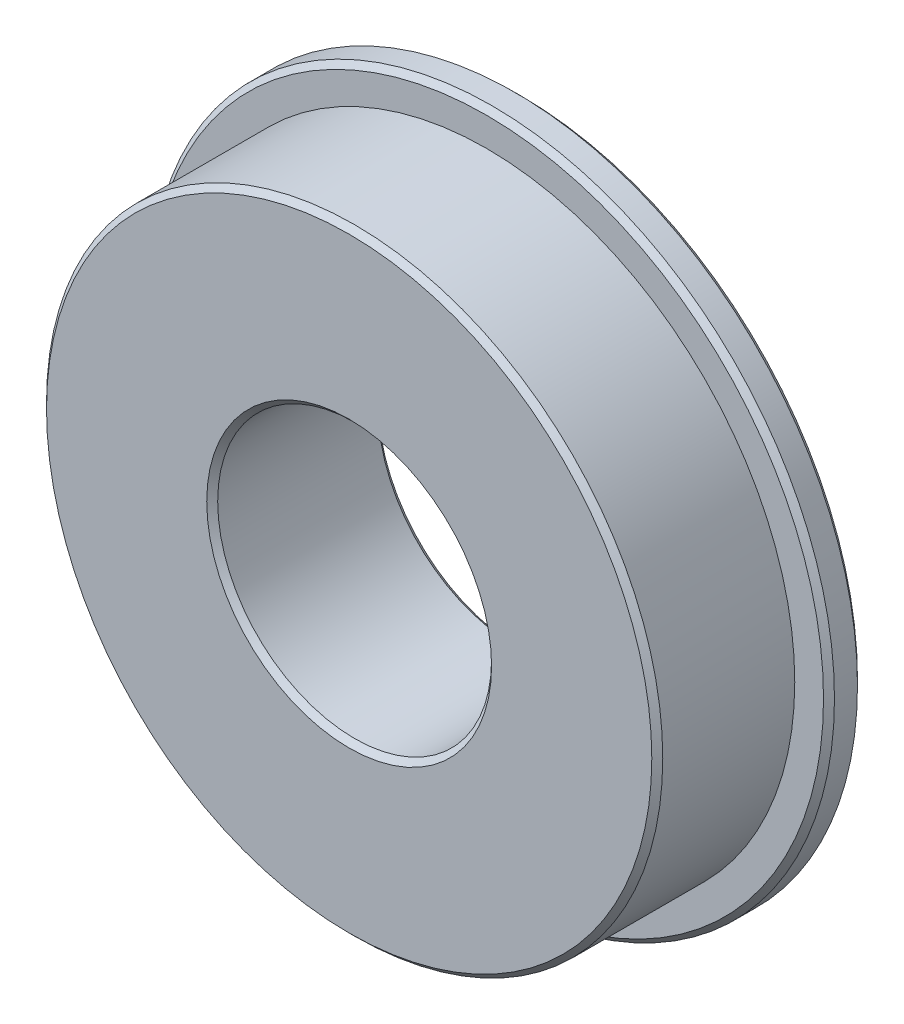
ISO-10303-21;
HEADER;
FILE_DESCRIPTION(('STEP AP214'),'2;1');
FILE_NAME('part.step','',(''),(''),'','','');
FILE_SCHEMA(('AUTOMOTIVE_DESIGN { 1 0 10303 214 1 1 1 1 }'));
ENDSEC;
DATA;
#1=APPLICATION_CONTEXT('core data for automotive mechanical design processes');
#2=APPLICATION_PROTOCOL_DEFINITION('international standard','automotive_design',2000,#1);
#3=PRODUCT_CONTEXT('',#1,'mechanical');
#4=PRODUCT('Part','Part','',(#3));
#5=PRODUCT_RELATED_PRODUCT_CATEGORY('part','',(#4));
#6=PRODUCT_DEFINITION_FORMATION('','',#4);
#7=PRODUCT_DEFINITION_CONTEXT('part definition',#1,'design');
#8=PRODUCT_DEFINITION('design','',#6,#7);
#9=PRODUCT_DEFINITION_SHAPE('','',#8);
#10=(LENGTH_UNIT() NAMED_UNIT(*) SI_UNIT(.MILLI.,.METRE.));
#11=(NAMED_UNIT(*) PLANE_ANGLE_UNIT() SI_UNIT($,.RADIAN.));
#12=(NAMED_UNIT(*) SI_UNIT($,.STERADIAN.) SOLID_ANGLE_UNIT());
#13=UNCERTAINTY_MEASURE_WITH_UNIT(LENGTH_MEASURE(1.E-05),#10,'distance_accuracy_value','');
#14=(GEOMETRIC_REPRESENTATION_CONTEXT(3) GLOBAL_UNCERTAINTY_ASSIGNED_CONTEXT((#13)) GLOBAL_UNIT_ASSIGNED_CONTEXT((#10,
#11,#12)) REPRESENTATION_CONTEXT('',''));
#15=CARTESIAN_POINT('',(0.,0.,0.));
#16=DIRECTION('',(0.,0.,1.));
#17=DIRECTION('',(1.,0.,0.));
#18=AXIS2_PLACEMENT_3D('',#15,#16,#17);
#19=CARTESIAN_POINT('',(-8.86153846180001,6.04195804306,0.));
#20=DIRECTION('',(0.,0.,1.));
#21=DIRECTION('',(1.,0.,0.));
#22=AXIS2_PLACEMENT_3D('',#19,#20,#21);
#23=CONICAL_SURFACE('',#22,15.621,0.785398163397446);
#24=CARTESIAN_POINT('',(-8.86153846180001,6.04195804306,0.));
#25=DIRECTION('',(0.,0.,1.));
#26=DIRECTION('',(1.,0.,0.));
#27=AXIS2_PLACEMENT_3D('',#24,#25,#26);
#28=CIRCLE('',#27,15.621);
#29=CARTESIAN_POINT('',(6.7594615382,6.04195804306,0.));
#30=VERTEX_POINT('',#29);
#31=EDGE_CURVE('E20',#30,#30,#28,.T.);
#32=ORIENTED_EDGE('',*,*,#31,.T.);
#33=EDGE_LOOP('',(#32));
#34=FACE_BOUND('',#33,.T.);
#35=CARTESIAN_POINT('',(-8.86153846180001,6.04195804306,0.2539999991872));
#36=DIRECTION('',(0.,0.,1.));
#37=DIRECTION('',(-1.,0.,0.));
#38=AXIS2_PLACEMENT_3D('',#35,#36,#37);
#39=CIRCLE('',#38,15.875);
#40=CARTESIAN_POINT('',(-24.7365384618,6.04195804306,0.2539999991872));
#41=VERTEX_POINT('',#40);
#42=EDGE_CURVE('E52',#41,#41,#39,.F.);
#43=ORIENTED_EDGE('',*,*,#42,.T.);
#44=EDGE_LOOP('',(#43));
#45=FACE_BOUND('',#44,.T.);
#46=ADVANCED_FACE('F17',(#34,#45),#23,.T.);
#47=CARTESIAN_POINT('',(0.,0.,0.));
#48=DIRECTION('',(0.,0.,-1.));
#49=DIRECTION('',(-1.,0.,0.));
#50=AXIS2_PLACEMENT_3D('',#47,#48,#49);
#51=PLANE('',#50);
#52=CARTESIAN_POINT('',(-8.86153846180001,6.04195804306,0.));
#53=DIRECTION('',(0.,0.,-1.));
#54=DIRECTION('',(0.,1.,0.));
#55=AXIS2_PLACEMENT_3D('',#52,#53,#54);
#56=CIRCLE('',#55,6.604);
#57=CARTESIAN_POINT('',(-2.25753846169458,6.04195804306,0.));
#58=VERTEX_POINT('',#57);
#59=CARTESIAN_POINT('',(-15.4655384619054,6.04195804306,0.));
#60=VERTEX_POINT('',#59);
#61=EDGE_CURVE('E43',#58,#60,#56,.F.);
#62=ORIENTED_EDGE('',*,*,#61,.T.);
#63=CARTESIAN_POINT('',(-8.86153846180001,6.04195804306,1.05423428233692E-10));
#64=DIRECTION('',(0.,0.,-1.));
#65=DIRECTION('',(0.,1.,0.));
#66=AXIS2_PLACEMENT_3D('',#63,#64,#65);
#67=CIRCLE('',#66,6.60400000010542);
#68=EDGE_CURVE('E50',#60,#58,#67,.F.);
#69=ORIENTED_EDGE('',*,*,#68,.T.);
#70=EDGE_LOOP('',(#62,#69));
#71=FACE_BOUND('',#70,.T.);
#72=ORIENTED_EDGE('',*,*,#31,.F.);
#73=EDGE_LOOP('',(#72));
#74=FACE_BOUND('',#73,.T.);
#75=ADVANCED_FACE('F48',(#71,#74),#51,.T.);
#76=CARTESIAN_POINT('',(-8.86153846180001,6.04195804306,0.2539999991872));
#77=DIRECTION('',(0.,0.,1.));
#78=DIRECTION('',(1.,0.,0.));
#79=AXIS2_PLACEMENT_3D('',#76,#77,#78);
#80=CYLINDRICAL_SURFACE('',#79,15.875);
#81=CARTESIAN_POINT('',(-8.86153846180001,6.04195804306,1.3208));
#82=DIRECTION('',(0.,0.,-1.));
#83=DIRECTION('',(1.,0.,0.));
#84=AXIS2_PLACEMENT_3D('',#81,#82,#83);
#85=CIRCLE('',#84,15.875);
#86=CARTESIAN_POINT('',(7.0134615382,6.04195804306,1.3208));
#87=VERTEX_POINT('',#86);
#88=EDGE_CURVE('E66',#87,#87,#85,.T.);
#89=ORIENTED_EDGE('',*,*,#88,.T.);
#90=EDGE_LOOP('',(#89));
#91=FACE_BOUND('',#90,.T.);
#92=ORIENTED_EDGE('',*,*,#42,.F.);
#93=EDGE_LOOP('',(#92));
#94=FACE_BOUND('',#93,.T.);
#95=ADVANCED_FACE('F131',(#91,#94),#80,.T.);
#96=CARTESIAN_POINT('',(-8.86153846180001,6.04195804306,0.254));
#97=DIRECTION('',(0.,0.,-1.));
#98=DIRECTION('',(0.,1.,0.));
#99=AXIS2_PLACEMENT_3D('',#96,#97,#98);
#100=CONICAL_SURFACE('',#99,6.35,0.785398163397446);
#101=CARTESIAN_POINT('',(-8.86153846180001,6.04195804306,0.2539999991872));
#102=DIRECTION('',(0.,0.,1.));
#103=DIRECTION('',(1.,0.,0.));
#104=AXIS2_PLACEMENT_3D('',#101,#102,#103);
#105=CIRCLE('',#104,6.350000000254);
#106=CARTESIAN_POINT('',(-2.51153846170475,6.04195804306,0.253999999422151));
#107=VERTEX_POINT('',#106);
#108=CARTESIAN_POINT('',(-15.2115384619969,6.04195804306,0.25399999932055));
#109=VERTEX_POINT('',#108);
#110=EDGE_CURVE('E34',#107,#109,#105,.T.);
#111=ORIENTED_EDGE('',*,*,#110,.T.);
#112=DIRECTION('',(0.707106781126475,0.,0.70710678124662));
#113=VECTOR('',#112,1.);
#114=CARTESIAN_POINT('',(-15.338538462054,6.04195804306,0.126999999978421));
#115=LINE('',#114,#113);
#116=EDGE_CURVE('E51',#109,#60,#115,.F.);
#117=ORIENTED_EDGE('',*,*,#116,.T.);
#118=ORIENTED_EDGE('',*,*,#61,.F.);
#119=DIRECTION('',(0.707106781126474,0.,-0.707106781246621));
#120=VECTOR('',#119,1.);
#121=CARTESIAN_POINT('',(-2.384538461546,6.04195804306,0.126999999978421));
#122=LINE('',#121,#120);
#123=EDGE_CURVE('E56',#58,#107,#122,.F.);
#124=ORIENTED_EDGE('',*,*,#123,.T.);
#125=EDGE_LOOP('',(#111,#117,#118,#124));
#126=FACE_BOUND('',#125,.T.);
#127=ADVANCED_FACE('F58',(#126),#100,.F.);
#128=CARTESIAN_POINT('',(-8.86153846180001,6.04195804306,0.254));
#129=DIRECTION('',(0.,0.,-1.));
#130=DIRECTION('',(0.,1.,0.));
#131=AXIS2_PLACEMENT_3D('',#128,#129,#130);
#132=CONICAL_SURFACE('',#131,6.350000000254,0.785398163312491);
#133=ORIENTED_EDGE('',*,*,#123,.F.);
#134=ORIENTED_EDGE('',*,*,#68,.F.);
#135=ORIENTED_EDGE('',*,*,#116,.F.);
#136=CARTESIAN_POINT('',(-8.86153846180001,6.04195804306,0.2539999991872));
#137=DIRECTION('',(0.,0.,1.));
#138=DIRECTION('',(-1.,0.,0.));
#139=AXIS2_PLACEMENT_3D('',#136,#137,#138);
#140=CIRCLE('',#139,6.35);
#141=EDGE_CURVE('E80',#109,#107,#140,.T.);
#142=ORIENTED_EDGE('',*,*,#141,.T.);
#143=EDGE_LOOP('',(#133,#134,#135,#142));
#144=FACE_BOUND('',#143,.T.);
#145=ADVANCED_FACE('F54',(#144),#132,.F.);
#146=CARTESIAN_POINT('',(-8.86153846180001,6.04195804306,1.5748));
#147=DIRECTION('',(0.,0.,-1.));
#148=DIRECTION('',(0.,1.,0.));
#149=AXIS2_PLACEMENT_3D('',#146,#147,#148);
#150=CONICAL_SURFACE('',#149,15.621,0.785398163397446);
#151=CARTESIAN_POINT('',(-8.86153846180001,6.04195804306,1.5748));
#152=DIRECTION('',(0.,0.,-1.));
#153=DIRECTION('',(0.,1.,0.));
#154=AXIS2_PLACEMENT_3D('',#151,#152,#153);
#155=CIRCLE('',#154,15.621);
#156=CARTESIAN_POINT('',(-8.86153846180001,21.66295804306,1.5748));
#157=VERTEX_POINT('',#156);
#158=EDGE_CURVE('E78',#157,#157,#155,.T.);
#159=ORIENTED_EDGE('',*,*,#158,.T.);
#160=EDGE_LOOP('',(#159));
#161=FACE_BOUND('',#160,.T.);
#162=ORIENTED_EDGE('',*,*,#88,.F.);
#163=EDGE_LOOP('',(#162));
#164=FACE_BOUND('',#163,.T.);
#165=ADVANCED_FACE('F124',(#161,#164),#150,.T.);
#166=CARTESIAN_POINT('',(-8.86153846180001,6.04195804306,0.2539999991872));
#167=DIRECTION('',(0.,0.,1.));
#168=DIRECTION('',(1.,0.,0.));
#169=AXIS2_PLACEMENT_3D('',#166,#167,#168);
#170=CYLINDRICAL_SURFACE('',#169,6.35);
#171=ORIENTED_EDGE('',*,*,#141,.F.);
#172=ORIENTED_EDGE('',*,*,#110,.F.);
#173=EDGE_LOOP('',(#171,#172));
#174=FACE_BOUND('',#173,.T.);
#175=CARTESIAN_POINT('',(-8.86153846180001,6.04195804306,7.6962));
#176=DIRECTION('',(0.,0.,1.));
#177=DIRECTION('',(-1.,0.,0.));
#178=AXIS2_PLACEMENT_3D('',#175,#176,#177);
#179=CIRCLE('',#178,6.35);
#180=CARTESIAN_POINT('',(-15.2115384618,6.04195804306,7.6962));
#181=VERTEX_POINT('',#180);
#182=EDGE_CURVE('E77',#181,#181,#179,.T.);
#183=ORIENTED_EDGE('',*,*,#182,.T.);
#184=EDGE_LOOP('',(#183));
#185=FACE_BOUND('',#184,.T.);
#186=ADVANCED_FACE('F120',(#174,#185),#170,.F.);
#187=CARTESIAN_POINT('',(0.,0.,1.57480000007742));
#188=DIRECTION('',(0.,0.,-1.));
#189=DIRECTION('',(-1.,0.,0.));
#190=AXIS2_PLACEMENT_3D('',#187,#188,#189);
#191=PLANE('',#190);
#192=CARTESIAN_POINT('',(-8.86153846180001,6.04195804306,1.574800000762));
#193=DIRECTION('',(0.,0.,1.));
#194=DIRECTION('',(0.,-1.,0.));
#195=AXIS2_PLACEMENT_3D('',#192,#193,#194);
#196=CIRCLE('',#195,14.2875);
#197=CARTESIAN_POINT('',(-8.86153846180001,-8.24554195694001,1.574800000762));
#198=VERTEX_POINT('',#197);
#199=EDGE_CURVE('E74',#198,#198,#196,.F.);
#200=ORIENTED_EDGE('',*,*,#199,.T.);
#201=EDGE_LOOP('',(#200));
#202=FACE_BOUND('',#201,.T.);
#203=ORIENTED_EDGE('',*,*,#158,.F.);
#204=EDGE_LOOP('',(#203));
#205=FACE_BOUND('',#204,.T.);
#206=ADVANCED_FACE('F116',(#202,#205),#191,.F.);
#207=CARTESIAN_POINT('',(-8.86153846180001,6.04195804306,7.6962));
#208=DIRECTION('',(0.,0.,1.));
#209=DIRECTION('',(1.,0.,0.));
#210=AXIS2_PLACEMENT_3D('',#207,#208,#209);
#211=CONICAL_SURFACE('',#210,6.35,0.785398163397445);
#212=CARTESIAN_POINT('',(-8.86153846180001,6.04195804306,7.9502));
#213=DIRECTION('',(0.,0.,1.));
#214=DIRECTION('',(1.,0.,0.));
#215=AXIS2_PLACEMENT_3D('',#212,#213,#214);
#216=CIRCLE('',#215,6.604);
#217=CARTESIAN_POINT('',(-2.2575384618,6.04195804306,7.9502));
#218=VERTEX_POINT('',#217);
#219=EDGE_CURVE('E71',#218,#218,#216,.T.);
#220=ORIENTED_EDGE('',*,*,#219,.T.);
#221=EDGE_LOOP('',(#220));
#222=FACE_BOUND('',#221,.T.);
#223=ORIENTED_EDGE('',*,*,#182,.F.);
#224=EDGE_LOOP('',(#223));
#225=FACE_BOUND('',#224,.T.);
#226=ADVANCED_FACE('F112',(#222,#225),#211,.F.);
#227=CARTESIAN_POINT('',(-8.86153846180001,6.04195804306,1.5748));
#228=DIRECTION('',(0.,0.,1.));
#229=DIRECTION('',(0.,-1.,0.));
#230=AXIS2_PLACEMENT_3D('',#227,#228,#229);
#231=CYLINDRICAL_SURFACE('',#230,14.2875);
#232=ORIENTED_EDGE('',*,*,#199,.F.);
#233=EDGE_LOOP('',(#232));
#234=FACE_BOUND('',#233,.T.);
#235=CARTESIAN_POINT('',(-8.86153846180001,6.04195804306,7.6962));
#236=DIRECTION('',(0.,0.,-1.));
#237=DIRECTION('',(-1.,0.,0.));
#238=AXIS2_PLACEMENT_3D('',#235,#236,#237);
#239=CIRCLE('',#238,14.2875);
#240=CARTESIAN_POINT('',(-23.1490384618,6.04195804306,7.6962));
#241=VERTEX_POINT('',#240);
#242=EDGE_CURVE('E26',#241,#241,#239,.T.);
#243=ORIENTED_EDGE('',*,*,#242,.T.);
#244=EDGE_LOOP('',(#243));
#245=FACE_BOUND('',#244,.T.);
#246=ADVANCED_FACE('F95',(#234,#245),#231,.T.);
#247=CARTESIAN_POINT('',(0.,0.,7.9502000028258));
#248=DIRECTION('',(0.,0.,-1.));
#249=DIRECTION('',(-1.,0.,0.));
#250=AXIS2_PLACEMENT_3D('',#247,#248,#249);
#251=PLANE('',#250);
#252=ORIENTED_EDGE('',*,*,#219,.F.);
#253=EDGE_LOOP('',(#252));
#254=FACE_BOUND('',#253,.T.);
#255=CARTESIAN_POINT('',(-8.86153846180001,6.04195804306,7.9502));
#256=DIRECTION('',(0.,0.,-1.));
#257=DIRECTION('',(-1.,0.,0.));
#258=AXIS2_PLACEMENT_3D('',#255,#256,#257);
#259=CIRCLE('',#258,14.0335);
#260=CARTESIAN_POINT('',(-22.8950384618,6.04195804306,7.9502));
#261=VERTEX_POINT('',#260);
#262=EDGE_CURVE('E11',#261,#261,#259,.F.);
#263=ORIENTED_EDGE('',*,*,#262,.T.);
#264=EDGE_LOOP('',(#263));
#265=FACE_BOUND('',#264,.T.);
#266=ADVANCED_FACE('F99',(#254,#265),#251,.F.);
#267=CARTESIAN_POINT('',(-8.86153846180001,6.04195804306,7.9502));
#268=DIRECTION('',(0.,0.,-1.));
#269=DIRECTION('',(-1.,0.,0.));
#270=AXIS2_PLACEMENT_3D('',#267,#268,#269);
#271=CONICAL_SURFACE('',#270,14.0335,0.785398163397448);
#272=ORIENTED_EDGE('',*,*,#262,.F.);
#273=EDGE_LOOP('',(#272));
#274=FACE_BOUND('',#273,.T.);
#275=ORIENTED_EDGE('',*,*,#242,.F.);
#276=EDGE_LOOP('',(#275));
#277=FACE_BOUND('',#276,.T.);
#278=ADVANCED_FACE('F97',(#274,#277),#271,.T.);
#279=CLOSED_SHELL('',(#46,#75,#95,#127,#145,#165,#186,#206,#226,#246,#266,#278));
#280=MANIFOLD_SOLID_BREP('B1',#279);
#281=ADVANCED_BREP_SHAPE_REPRESENTATION('',(#18,#280),#14);
#282=SHAPE_DEFINITION_REPRESENTATION(#9,#281);
ENDSEC;
END-ISO-10303-21;
